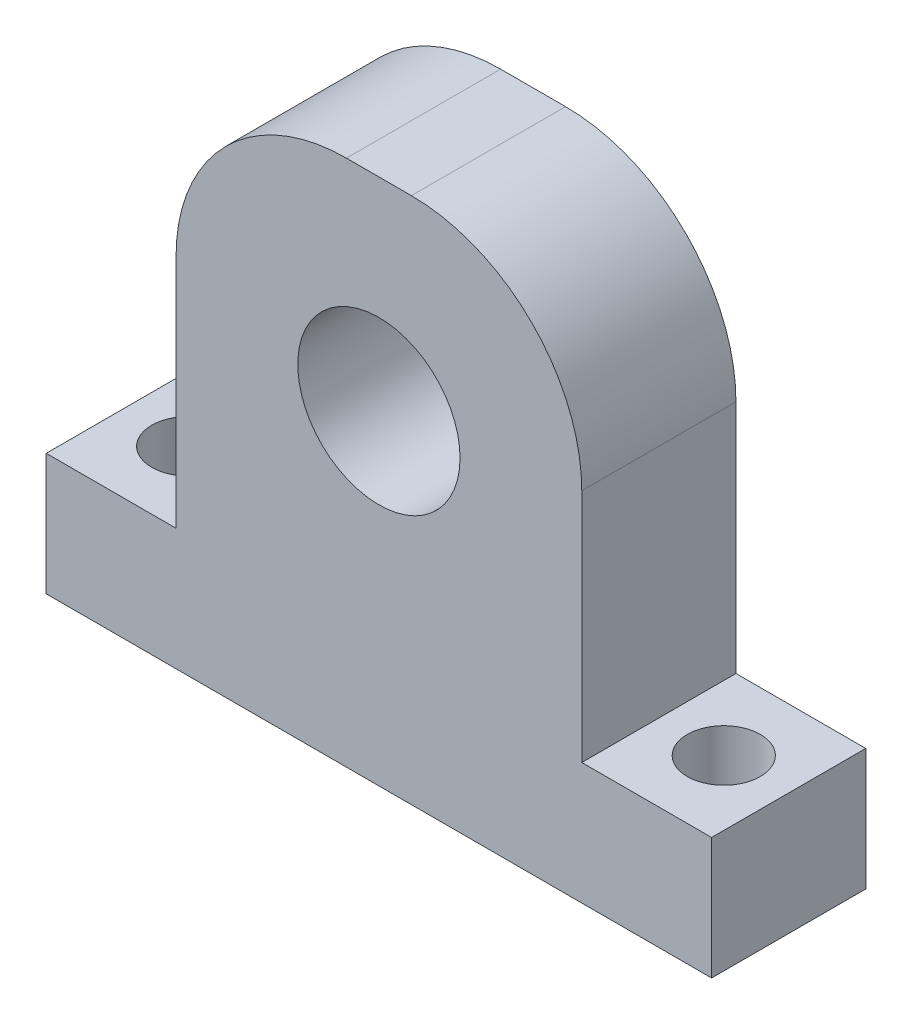
ISO-10303-21;
HEADER;
FILE_DESCRIPTION(('STEP AP214'),'2;1');
FILE_NAME('part.step','',(''),(''),'','','');
FILE_SCHEMA(('AUTOMOTIVE_DESIGN { 1 0 10303 214 1 1 1 1 }'));
ENDSEC;
DATA;
#1=APPLICATION_CONTEXT('core data for automotive mechanical design processes');
#2=APPLICATION_PROTOCOL_DEFINITION('international standard','automotive_design',2000,#1);
#3=PRODUCT_CONTEXT('',#1,'mechanical');
#4=PRODUCT('Part','Part','',(#3));
#5=PRODUCT_RELATED_PRODUCT_CATEGORY('part','',(#4));
#6=PRODUCT_DEFINITION_FORMATION('','',#4);
#7=PRODUCT_DEFINITION_CONTEXT('part definition',#1,'design');
#8=PRODUCT_DEFINITION('design','',#6,#7);
#9=PRODUCT_DEFINITION_SHAPE('','',#8);
#10=(LENGTH_UNIT() NAMED_UNIT(*) SI_UNIT(.MILLI.,.METRE.));
#11=(NAMED_UNIT(*) PLANE_ANGLE_UNIT() SI_UNIT($,.RADIAN.));
#12=(NAMED_UNIT(*) SI_UNIT($,.STERADIAN.) SOLID_ANGLE_UNIT());
#13=UNCERTAINTY_MEASURE_WITH_UNIT(LENGTH_MEASURE(1.E-05),#10,'distance_accuracy_value','');
#14=(GEOMETRIC_REPRESENTATION_CONTEXT(3) GLOBAL_UNCERTAINTY_ASSIGNED_CONTEXT((#13)) GLOBAL_UNIT_ASSIGNED_CONTEXT((#10,
#11,#12)) REPRESENTATION_CONTEXT('',''));
#15=CARTESIAN_POINT('',(0.,0.,0.));
#16=DIRECTION('',(0.,0.,1.));
#17=DIRECTION('',(1.,0.,0.));
#18=AXIS2_PLACEMENT_3D('',#15,#16,#17);
#19=CARTESIAN_POINT('',(3.99999999999999,36.5,19.));
#20=DIRECTION('',(0.,0.,1.));
#21=DIRECTION('',(1.,0.,0.));
#22=AXIS2_PLACEMENT_3D('',#19,#20,#21);
#23=CYLINDRICAL_SURFACE('',#22,21.);
#24=DIRECTION('',(0.,0.,1.));
#25=VECTOR('',#24,1.);
#26=CARTESIAN_POINT('',(25.,36.5,19.));
#27=LINE('',#26,#25);
#28=CARTESIAN_POINT('',(25.,36.5,0.));
#29=VERTEX_POINT('',#28);
#30=CARTESIAN_POINT('',(25.,36.5,19.));
#31=VERTEX_POINT('',#30);
#32=EDGE_CURVE('E196',#29,#31,#27,.T.);
#33=ORIENTED_EDGE('',*,*,#32,.F.);
#34=CARTESIAN_POINT('',(3.99999999999999,36.5,0.));
#35=DIRECTION('',(0.,0.,1.));
#36=DIRECTION('',(1.,0.,0.));
#37=AXIS2_PLACEMENT_3D('',#34,#35,#36);
#38=CIRCLE('',#37,21.);
#39=CARTESIAN_POINT('',(3.99999999999999,57.5,0.));
#40=VERTEX_POINT('',#39);
#41=EDGE_CURVE('E49',#40,#29,#38,.F.);
#42=ORIENTED_EDGE('',*,*,#41,.F.);
#43=DIRECTION('',(0.,0.,1.));
#44=VECTOR('',#43,1.);
#45=CARTESIAN_POINT('',(4.,57.5,19.));
#46=LINE('',#45,#44);
#47=CARTESIAN_POINT('',(3.99999999999999,57.5,19.));
#48=VERTEX_POINT('',#47);
#49=EDGE_CURVE('E199',#48,#40,#46,.F.);
#50=ORIENTED_EDGE('',*,*,#49,.F.);
#51=CARTESIAN_POINT('',(3.99999999999999,36.5,19.));
#52=DIRECTION('',(0.,0.,1.));
#53=DIRECTION('',(1.,0.,0.));
#54=AXIS2_PLACEMENT_3D('',#51,#52,#53);
#55=CIRCLE('',#54,21.);
#56=EDGE_CURVE('E11',#31,#48,#55,.T.);
#57=ORIENTED_EDGE('',*,*,#56,.F.);
#58=EDGE_LOOP('',(#33,#42,#50,#57));
#59=FACE_BOUND('',#58,.T.);
#60=ADVANCED_FACE('F41',(#59),#23,.T.);
#61=CARTESIAN_POINT('',(-4.00000000000001,36.5,19.));
#62=DIRECTION('',(0.,0.,1.));
#63=DIRECTION('',(1.,0.,0.));
#64=AXIS2_PLACEMENT_3D('',#61,#62,#63);
#65=CYLINDRICAL_SURFACE('',#64,21.);
#66=DIRECTION('',(0.,0.,-1.));
#67=VECTOR('',#66,1.);
#68=CARTESIAN_POINT('',(-25.,36.5,19.));
#69=LINE('',#68,#67);
#70=CARTESIAN_POINT('',(-25.,36.5,19.));
#71=VERTEX_POINT('',#70);
#72=CARTESIAN_POINT('',(-25.,36.5,0.));
#73=VERTEX_POINT('',#72);
#74=EDGE_CURVE('E135',#71,#73,#69,.T.);
#75=ORIENTED_EDGE('',*,*,#74,.F.);
#76=CARTESIAN_POINT('',(-4.00000000000001,36.5,19.));
#77=DIRECTION('',(0.,0.,1.));
#78=DIRECTION('',(1.,0.,0.));
#79=AXIS2_PLACEMENT_3D('',#76,#77,#78);
#80=CIRCLE('',#79,21.);
#81=CARTESIAN_POINT('',(-4.,57.5,19.));
#82=VERTEX_POINT('',#81);
#83=EDGE_CURVE('E121',#82,#71,#80,.T.);
#84=ORIENTED_EDGE('',*,*,#83,.F.);
#85=DIRECTION('',(0.,0.,-1.));
#86=VECTOR('',#85,1.);
#87=CARTESIAN_POINT('',(-4.,57.5,19.));
#88=LINE('',#87,#86);
#89=CARTESIAN_POINT('',(-4.,57.5,0.));
#90=VERTEX_POINT('',#89);
#91=EDGE_CURVE('E190',#90,#82,#88,.F.);
#92=ORIENTED_EDGE('',*,*,#91,.F.);
#93=CARTESIAN_POINT('',(-4.00000000000001,36.5,0.));
#94=DIRECTION('',(0.,0.,1.));
#95=DIRECTION('',(1.,0.,0.));
#96=AXIS2_PLACEMENT_3D('',#93,#94,#95);
#97=CIRCLE('',#96,21.);
#98=EDGE_CURVE('E194',#73,#90,#97,.F.);
#99=ORIENTED_EDGE('',*,*,#98,.F.);
#100=EDGE_LOOP('',(#75,#84,#92,#99));
#101=FACE_BOUND('',#100,.T.);
#102=ADVANCED_FACE('F226',(#101),#65,.T.);
#103=CARTESIAN_POINT('',(25.,0.,19.));
#104=DIRECTION('',(1.,0.,0.));
#105=DIRECTION('',(0.,1.,0.));
#106=AXIS2_PLACEMENT_3D('',#103,#104,#105);
#107=PLANE('',#106);
#108=DIRECTION('',(0.,-1.,0.));
#109=VECTOR('',#108,1.);
#110=CARTESIAN_POINT('',(25.,0.,0.));
#111=LINE('',#110,#109);
#112=CARTESIAN_POINT('',(25.,7.5,0.));
#113=VERTEX_POINT('',#112);
#114=EDGE_CURVE('E163',#29,#113,#111,.T.);
#115=ORIENTED_EDGE('',*,*,#114,.F.);
#116=ORIENTED_EDGE('',*,*,#32,.T.);
#117=DIRECTION('',(0.,-1.,0.));
#118=VECTOR('',#117,1.);
#119=CARTESIAN_POINT('',(25.,0.,19.));
#120=LINE('',#119,#118);
#121=CARTESIAN_POINT('',(25.,7.5,19.));
#122=VERTEX_POINT('',#121);
#123=EDGE_CURVE('E209',#31,#122,#120,.T.);
#124=ORIENTED_EDGE('',*,*,#123,.T.);
#125=DIRECTION('',(0.,0.,-1.));
#126=VECTOR('',#125,1.);
#127=CARTESIAN_POINT('',(25.,7.5,19.));
#128=LINE('',#127,#126);
#129=EDGE_CURVE('E146',#122,#113,#128,.T.);
#130=ORIENTED_EDGE('',*,*,#129,.T.);
#131=EDGE_LOOP('',(#115,#116,#124,#130));
#132=FACE_BOUND('',#131,.T.);
#133=ADVANCED_FACE('F207',(#132),#107,.T.);
#134=CARTESIAN_POINT('',(0.,57.5,19.));
#135=DIRECTION('',(0.,1.,0.));
#136=DIRECTION('',(-1.,0.,0.));
#137=AXIS2_PLACEMENT_3D('',#134,#135,#136);
#138=PLANE('',#137);
#139=DIRECTION('',(1.,0.,0.));
#140=VECTOR('',#139,1.);
#141=CARTESIAN_POINT('',(0.,57.5,19.));
#142=LINE('',#141,#140);
#143=EDGE_CURVE('E125',#82,#48,#142,.T.);
#144=ORIENTED_EDGE('',*,*,#143,.T.);
#145=ORIENTED_EDGE('',*,*,#49,.T.);
#146=DIRECTION('',(1.,0.,0.));
#147=VECTOR('',#146,1.);
#148=CARTESIAN_POINT('',(0.,57.5,0.));
#149=LINE('',#148,#147);
#150=EDGE_CURVE('E166',#90,#40,#149,.T.);
#151=ORIENTED_EDGE('',*,*,#150,.F.);
#152=ORIENTED_EDGE('',*,*,#91,.T.);
#153=EDGE_LOOP('',(#144,#145,#151,#152));
#154=FACE_BOUND('',#153,.T.);
#155=ADVANCED_FACE('F223',(#154),#138,.T.);
#156=CARTESIAN_POINT('',(-25.,0.,19.));
#157=DIRECTION('',(1.,0.,0.));
#158=DIRECTION('',(0.,1.,0.));
#159=AXIS2_PLACEMENT_3D('',#156,#157,#158);
#160=PLANE('',#159);
#161=DIRECTION('',(0.,-1.,0.));
#162=VECTOR('',#161,1.);
#163=CARTESIAN_POINT('',(-25.,0.,19.));
#164=LINE('',#163,#162);
#165=CARTESIAN_POINT('',(-25.,7.5,19.));
#166=VERTEX_POINT('',#165);
#167=EDGE_CURVE('E115',#71,#166,#164,.T.);
#168=ORIENTED_EDGE('',*,*,#167,.F.);
#169=ORIENTED_EDGE('',*,*,#74,.T.);
#170=DIRECTION('',(0.,-1.,0.));
#171=VECTOR('',#170,1.);
#172=CARTESIAN_POINT('',(-25.,0.,0.));
#173=LINE('',#172,#171);
#174=CARTESIAN_POINT('',(-25.,7.5,0.));
#175=VERTEX_POINT('',#174);
#176=EDGE_CURVE('E131',#73,#175,#173,.T.);
#177=ORIENTED_EDGE('',*,*,#176,.T.);
#178=DIRECTION('',(0.,0.,-1.));
#179=VECTOR('',#178,1.);
#180=CARTESIAN_POINT('',(-25.,7.5,19.));
#181=LINE('',#180,#179);
#182=EDGE_CURVE('E128',#166,#175,#181,.T.);
#183=ORIENTED_EDGE('',*,*,#182,.F.);
#184=EDGE_LOOP('',(#168,#169,#177,#183));
#185=FACE_BOUND('',#184,.T.);
#186=ADVANCED_FACE('F129',(#185),#160,.F.);
#187=CARTESIAN_POINT('',(0.,7.5,19.));
#188=DIRECTION('',(0.,1.,0.));
#189=DIRECTION('',(0.,0.,1.));
#190=AXIS2_PLACEMENT_3D('',#187,#188,#189);
#191=PLANE('',#190);
#192=CARTESIAN_POINT('',(-33.,7.5,9.5));
#193=DIRECTION('',(0.,1.,0.));
#194=DIRECTION('',(0.,0.,1.));
#195=AXIS2_PLACEMENT_3D('',#192,#193,#194);
#196=CIRCLE('',#195,4.5);
#197=CARTESIAN_POINT('',(-33.,7.5,14.));
#198=VERTEX_POINT('',#197);
#199=EDGE_CURVE('E164',#198,#198,#196,.T.);
#200=ORIENTED_EDGE('',*,*,#199,.F.);
#201=EDGE_LOOP('',(#200));
#202=FACE_BOUND('',#201,.T.);
#203=DIRECTION('',(1.,0.,0.));
#204=VECTOR('',#203,1.);
#205=CARTESIAN_POINT('',(0.,7.5,0.));
#206=LINE('',#205,#204);
#207=CARTESIAN_POINT('',(-41.,7.5,0.));
#208=VERTEX_POINT('',#207);
#209=EDGE_CURVE('E170',#208,#175,#206,.T.);
#210=ORIENTED_EDGE('',*,*,#209,.F.);
#211=DIRECTION('',(0.,0.,-1.));
#212=VECTOR('',#211,1.);
#213=CARTESIAN_POINT('',(-41.,7.5,19.));
#214=LINE('',#213,#212);
#215=CARTESIAN_POINT('',(-41.,7.5,19.));
#216=VERTEX_POINT('',#215);
#217=EDGE_CURVE('E136',#216,#208,#214,.T.);
#218=ORIENTED_EDGE('',*,*,#217,.F.);
#219=DIRECTION('',(1.,0.,0.));
#220=VECTOR('',#219,1.);
#221=CARTESIAN_POINT('',(0.,7.5,19.));
#222=LINE('',#221,#220);
#223=EDGE_CURVE('E120',#216,#166,#222,.T.);
#224=ORIENTED_EDGE('',*,*,#223,.T.);
#225=ORIENTED_EDGE('',*,*,#182,.T.);
#226=EDGE_LOOP('',(#210,#218,#224,#225));
#227=FACE_BOUND('',#226,.T.);
#228=ADVANCED_FACE('F138',(#202,#227),#191,.T.);
#229=CARTESIAN_POINT('',(-41.,0.,19.));
#230=DIRECTION('',(1.,0.,0.));
#231=DIRECTION('',(0.,1.,0.));
#232=AXIS2_PLACEMENT_3D('',#229,#230,#231);
#233=PLANE('',#232);
#234=DIRECTION('',(0.,-1.,0.));
#235=VECTOR('',#234,1.);
#236=CARTESIAN_POINT('',(-41.,0.,0.));
#237=LINE('',#236,#235);
#238=CARTESIAN_POINT('',(-41.,-7.5,0.));
#239=VERTEX_POINT('',#238);
#240=EDGE_CURVE('E172',#208,#239,#237,.T.);
#241=ORIENTED_EDGE('',*,*,#240,.T.);
#242=DIRECTION('',(0.,0.,-1.));
#243=VECTOR('',#242,1.);
#244=CARTESIAN_POINT('',(-41.,-7.5,19.));
#245=LINE('',#244,#243);
#246=CARTESIAN_POINT('',(-41.,-7.5,19.));
#247=VERTEX_POINT('',#246);
#248=EDGE_CURVE('E185',#247,#239,#245,.T.);
#249=ORIENTED_EDGE('',*,*,#248,.F.);
#250=DIRECTION('',(0.,-1.,0.));
#251=VECTOR('',#250,1.);
#252=CARTESIAN_POINT('',(-41.,0.,19.));
#253=LINE('',#252,#251);
#254=EDGE_CURVE('E140',#216,#247,#253,.T.);
#255=ORIENTED_EDGE('',*,*,#254,.F.);
#256=ORIENTED_EDGE('',*,*,#217,.T.);
#257=EDGE_LOOP('',(#241,#249,#255,#256));
#258=FACE_BOUND('',#257,.T.);
#259=ADVANCED_FACE('F230',(#258),#233,.F.);
#260=CARTESIAN_POINT('',(0.,-7.5,19.));
#261=DIRECTION('',(0.,1.,0.));
#262=DIRECTION('',(0.,0.,1.));
#263=AXIS2_PLACEMENT_3D('',#260,#261,#262);
#264=PLANE('',#263);
#265=CARTESIAN_POINT('',(-33.,-7.5,9.5));
#266=DIRECTION('',(0.,-1.,0.));
#267=DIRECTION('',(0.,0.,-1.));
#268=AXIS2_PLACEMENT_3D('',#265,#266,#267);
#269=CIRCLE('',#268,4.5);
#270=CARTESIAN_POINT('',(-33.,-7.5,5.));
#271=VERTEX_POINT('',#270);
#272=EDGE_CURVE('E281',#271,#271,#269,.T.);
#273=ORIENTED_EDGE('',*,*,#272,.F.);
#274=EDGE_LOOP('',(#273));
#275=FACE_BOUND('',#274,.T.);
#276=CARTESIAN_POINT('',(33.,-7.5,9.49999999999998));
#277=DIRECTION('',(0.,-1.,0.));
#278=DIRECTION('',(0.,0.,1.));
#279=AXIS2_PLACEMENT_3D('',#276,#277,#278);
#280=CIRCLE('',#279,4.5);
#281=CARTESIAN_POINT('',(33.,-7.5,14.));
#282=VERTEX_POINT('',#281);
#283=EDGE_CURVE('E284',#282,#282,#280,.T.);
#284=ORIENTED_EDGE('',*,*,#283,.F.);
#285=EDGE_LOOP('',(#284));
#286=FACE_BOUND('',#285,.T.);
#287=DIRECTION('',(1.,0.,0.));
#288=VECTOR('',#287,1.);
#289=CARTESIAN_POINT('',(0.,-7.5,0.));
#290=LINE('',#289,#288);
#291=CARTESIAN_POINT('',(41.,-7.5,0.));
#292=VERTEX_POINT('',#291);
#293=EDGE_CURVE('E176',#239,#292,#290,.T.);
#294=ORIENTED_EDGE('',*,*,#293,.T.);
#295=DIRECTION('',(0.,0.,-1.));
#296=VECTOR('',#295,1.);
#297=CARTESIAN_POINT('',(41.,-7.5,19.));
#298=LINE('',#297,#296);
#299=CARTESIAN_POINT('',(41.,-7.5,19.));
#300=VERTEX_POINT('',#299);
#301=EDGE_CURVE('E183',#300,#292,#298,.T.);
#302=ORIENTED_EDGE('',*,*,#301,.F.);
#303=DIRECTION('',(1.,0.,0.));
#304=VECTOR('',#303,1.);
#305=CARTESIAN_POINT('',(0.,-7.5,19.));
#306=LINE('',#305,#304);
#307=EDGE_CURVE('E143',#247,#300,#306,.T.);
#308=ORIENTED_EDGE('',*,*,#307,.F.);
#309=ORIENTED_EDGE('',*,*,#248,.T.);
#310=EDGE_LOOP('',(#294,#302,#308,#309));
#311=FACE_BOUND('',#310,.T.);
#312=ADVANCED_FACE('F233',(#275,#286,#311),#264,.F.);
#313=CARTESIAN_POINT('',(41.,0.,19.));
#314=DIRECTION('',(1.,0.,0.));
#315=DIRECTION('',(0.,0.,-1.));
#316=AXIS2_PLACEMENT_3D('',#313,#314,#315);
#317=PLANE('',#316);
#318=DIRECTION('',(0.,-1.,0.));
#319=VECTOR('',#318,1.);
#320=CARTESIAN_POINT('',(41.,0.,0.));
#321=LINE('',#320,#319);
#322=CARTESIAN_POINT('',(41.,7.5,0.));
#323=VERTEX_POINT('',#322);
#324=EDGE_CURVE('E179',#323,#292,#321,.T.);
#325=ORIENTED_EDGE('',*,*,#324,.F.);
#326=DIRECTION('',(0.,0.,-1.));
#327=VECTOR('',#326,1.);
#328=CARTESIAN_POINT('',(41.,7.5,19.));
#329=LINE('',#328,#327);
#330=CARTESIAN_POINT('',(41.,7.5,19.));
#331=VERTEX_POINT('',#330);
#332=EDGE_CURVE('E152',#331,#323,#329,.T.);
#333=ORIENTED_EDGE('',*,*,#332,.F.);
#334=DIRECTION('',(0.,-1.,0.));
#335=VECTOR('',#334,1.);
#336=CARTESIAN_POINT('',(41.,0.,19.));
#337=LINE('',#336,#335);
#338=EDGE_CURVE('E147',#331,#300,#337,.T.);
#339=ORIENTED_EDGE('',*,*,#338,.T.);
#340=ORIENTED_EDGE('',*,*,#301,.T.);
#341=EDGE_LOOP('',(#325,#333,#339,#340));
#342=FACE_BOUND('',#341,.T.);
#343=ADVANCED_FACE('F234',(#342),#317,.T.);
#344=CARTESIAN_POINT('',(0.,32.5,19.));
#345=DIRECTION('',(0.,0.,-1.));
#346=DIRECTION('',(-1.,0.,0.));
#347=AXIS2_PLACEMENT_3D('',#344,#345,#346);
#348=CYLINDRICAL_SURFACE('',#347,10.);
#349=CARTESIAN_POINT('',(0.,32.5,19.));
#350=DIRECTION('',(0.,0.,1.));
#351=DIRECTION('',(1.,0.,0.));
#352=AXIS2_PLACEMENT_3D('',#349,#350,#351);
#353=CIRCLE('',#352,10.);
#354=CARTESIAN_POINT('',(9.99999999999998,32.5,19.));
#355=VERTEX_POINT('',#354);
#356=EDGE_CURVE('E212',#355,#355,#353,.T.);
#357=ORIENTED_EDGE('',*,*,#356,.T.);
#358=EDGE_LOOP('',(#357));
#359=FACE_BOUND('',#358,.T.);
#360=CARTESIAN_POINT('',(0.,32.5,0.));
#361=DIRECTION('',(0.,0.,1.));
#362=DIRECTION('',(1.,0.,0.));
#363=AXIS2_PLACEMENT_3D('',#360,#361,#362);
#364=CIRCLE('',#363,10.);
#365=CARTESIAN_POINT('',(9.99999999999998,32.5,0.));
#366=VERTEX_POINT('',#365);
#367=EDGE_CURVE('E160',#366,#366,#364,.T.);
#368=ORIENTED_EDGE('',*,*,#367,.F.);
#369=EDGE_LOOP('',(#368));
#370=FACE_BOUND('',#369,.T.);
#371=ADVANCED_FACE('F236',(#359,#370),#348,.F.);
#372=CARTESIAN_POINT('',(33.,7.5,9.49999999999998));
#373=DIRECTION('',(0.,1.,0.));
#374=DIRECTION('',(0.,0.,1.));
#375=AXIS2_PLACEMENT_3D('',#372,#373,#374);
#376=CIRCLE('',#375,4.5);
#377=CARTESIAN_POINT('',(33.,7.5,14.));
#378=VERTEX_POINT('',#377);
#379=EDGE_CURVE('E44',#378,#378,#376,.T.);
#380=ORIENTED_EDGE('',*,*,#379,.F.);
#381=EDGE_LOOP('',(#380));
#382=FACE_BOUND('',#381,.T.);
#383=EDGE_CURVE('E173',#113,#323,#206,.T.);
#384=ORIENTED_EDGE('',*,*,#383,.F.);
#385=ORIENTED_EDGE('',*,*,#129,.F.);
#386=EDGE_CURVE('E142',#122,#331,#222,.T.);
#387=ORIENTED_EDGE('',*,*,#386,.T.);
#388=ORIENTED_EDGE('',*,*,#332,.T.);
#389=EDGE_LOOP('',(#384,#385,#387,#388));
#390=FACE_BOUND('',#389,.T.);
#391=ADVANCED_FACE('F210',(#382,#390),#191,.T.);
#392=CARTESIAN_POINT('',(0.,0.,19.));
#393=DIRECTION('',(0.,0.,1.));
#394=DIRECTION('',(1.,0.,0.));
#395=AXIS2_PLACEMENT_3D('',#392,#393,#394);
#396=PLANE('',#395);
#397=ORIENTED_EDGE('',*,*,#356,.F.);
#398=EDGE_LOOP('',(#397));
#399=FACE_BOUND('',#398,.T.);
#400=ORIENTED_EDGE('',*,*,#123,.F.);
#401=ORIENTED_EDGE('',*,*,#56,.T.);
#402=ORIENTED_EDGE('',*,*,#143,.F.);
#403=ORIENTED_EDGE('',*,*,#83,.T.);
#404=ORIENTED_EDGE('',*,*,#167,.T.);
#405=ORIENTED_EDGE('',*,*,#223,.F.);
#406=ORIENTED_EDGE('',*,*,#254,.T.);
#407=ORIENTED_EDGE('',*,*,#307,.T.);
#408=ORIENTED_EDGE('',*,*,#338,.F.);
#409=ORIENTED_EDGE('',*,*,#386,.F.);
#410=EDGE_LOOP('',(#400,#401,#402,#403,#404,#405,#406,#407,#408,#409));
#411=FACE_BOUND('',#410,.T.);
#412=ADVANCED_FACE('F117',(#399,#411),#396,.T.);
#413=CARTESIAN_POINT('',(0.,0.,0.));
#414=DIRECTION('',(0.,0.,1.));
#415=DIRECTION('',(1.,0.,0.));
#416=AXIS2_PLACEMENT_3D('',#413,#414,#415);
#417=PLANE('',#416);
#418=ORIENTED_EDGE('',*,*,#367,.T.);
#419=EDGE_LOOP('',(#418));
#420=FACE_BOUND('',#419,.T.);
#421=ORIENTED_EDGE('',*,*,#150,.T.);
#422=ORIENTED_EDGE('',*,*,#41,.T.);
#423=ORIENTED_EDGE('',*,*,#114,.T.);
#424=ORIENTED_EDGE('',*,*,#383,.T.);
#425=ORIENTED_EDGE('',*,*,#324,.T.);
#426=ORIENTED_EDGE('',*,*,#293,.F.);
#427=ORIENTED_EDGE('',*,*,#240,.F.);
#428=ORIENTED_EDGE('',*,*,#209,.T.);
#429=ORIENTED_EDGE('',*,*,#176,.F.);
#430=ORIENTED_EDGE('',*,*,#98,.T.);
#431=EDGE_LOOP('',(#421,#422,#423,#424,#425,#426,#427,#428,#429,#430));
#432=FACE_BOUND('',#431,.T.);
#433=ADVANCED_FACE('F202',(#420,#432),#417,.F.);
#434=CARTESIAN_POINT('',(33.,11.5,9.49999999999998));
#435=DIRECTION('',(0.,-1.,0.));
#436=DIRECTION('',(0.,0.,-1.));
#437=AXIS2_PLACEMENT_3D('',#434,#435,#436);
#438=CYLINDRICAL_SURFACE('',#437,4.5);
#439=ORIENTED_EDGE('',*,*,#379,.T.);
#440=EDGE_LOOP('',(#439));
#441=FACE_BOUND('',#440,.T.);
#442=ORIENTED_EDGE('',*,*,#283,.T.);
#443=EDGE_LOOP('',(#442));
#444=FACE_BOUND('',#443,.T.);
#445=ADVANCED_FACE('F291',(#441,#444),#438,.F.);
#446=CARTESIAN_POINT('',(-33.,11.5,9.5));
#447=DIRECTION('',(0.,-1.,0.));
#448=DIRECTION('',(0.,0.,-1.));
#449=AXIS2_PLACEMENT_3D('',#446,#447,#448);
#450=CYLINDRICAL_SURFACE('',#449,4.5);
#451=ORIENTED_EDGE('',*,*,#199,.T.);
#452=EDGE_LOOP('',(#451));
#453=FACE_BOUND('',#452,.T.);
#454=ORIENTED_EDGE('',*,*,#272,.T.);
#455=EDGE_LOOP('',(#454));
#456=FACE_BOUND('',#455,.T.);
#457=ADVANCED_FACE('F294',(#453,#456),#450,.F.);
#458=CLOSED_SHELL('',(#60,#102,#133,#155,#186,#228,#259,#312,#343,#371,#391,#412,#433,#445,#457));
#459=MANIFOLD_SOLID_BREP('B2',#458);
#460=ADVANCED_BREP_SHAPE_REPRESENTATION('',(#18,#459),#14);
#461=SHAPE_DEFINITION_REPRESENTATION(#9,#460);
ENDSEC;
END-ISO-10303-21;
